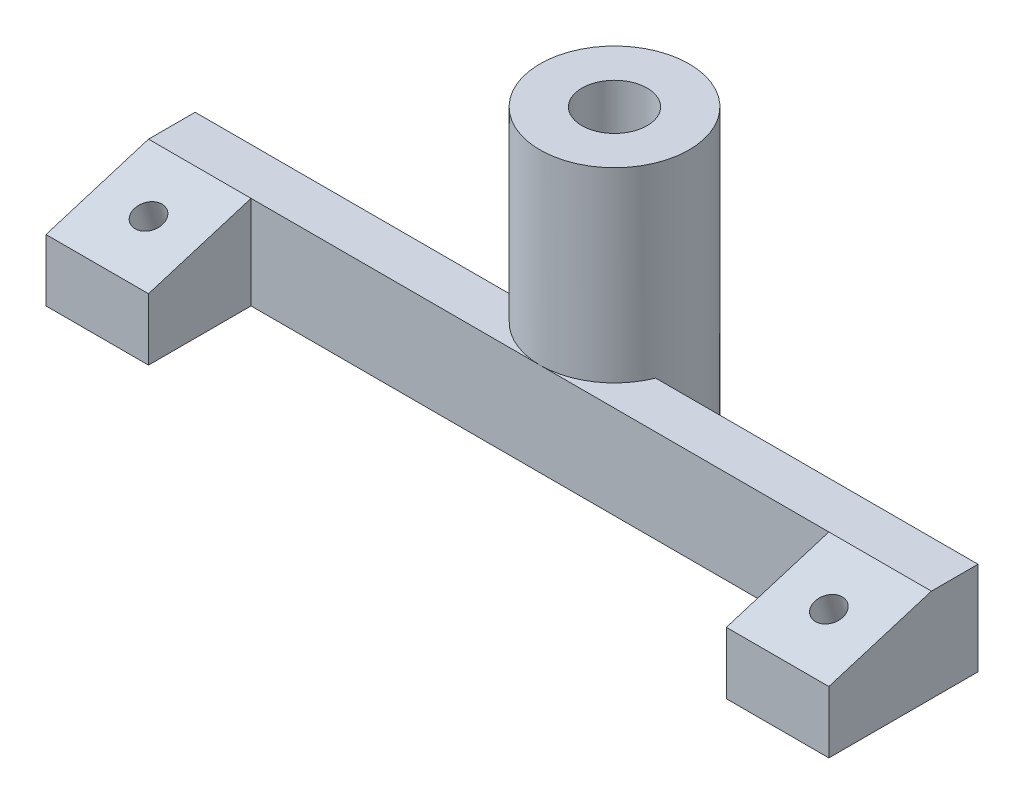
ISO-10303-21;
HEADER;
FILE_DESCRIPTION(('STEP AP214'),'2;1');
FILE_NAME('part.step','',(''),(''),'','','');
FILE_SCHEMA(('AUTOMOTIVE_DESIGN { 1 0 10303 214 1 1 1 1 }'));
ENDSEC;
DATA;
#1=APPLICATION_CONTEXT('core data for automotive mechanical design processes');
#2=APPLICATION_PROTOCOL_DEFINITION('international standard','automotive_design',2000,#1);
#3=PRODUCT_CONTEXT('',#1,'mechanical');
#4=PRODUCT('Part','Part','',(#3));
#5=PRODUCT_RELATED_PRODUCT_CATEGORY('part','',(#4));
#6=PRODUCT_DEFINITION_FORMATION('','',#4);
#7=PRODUCT_DEFINITION_CONTEXT('part definition',#1,'design');
#8=PRODUCT_DEFINITION('design','',#6,#7);
#9=PRODUCT_DEFINITION_SHAPE('','',#8);
#10=(LENGTH_UNIT() NAMED_UNIT(*) SI_UNIT(.MILLI.,.METRE.));
#11=(NAMED_UNIT(*) PLANE_ANGLE_UNIT() SI_UNIT($,.RADIAN.));
#12=(NAMED_UNIT(*) SI_UNIT($,.STERADIAN.) SOLID_ANGLE_UNIT());
#13=UNCERTAINTY_MEASURE_WITH_UNIT(LENGTH_MEASURE(1.E-05),#10,'distance_accuracy_value','');
#14=(GEOMETRIC_REPRESENTATION_CONTEXT(3) GLOBAL_UNCERTAINTY_ASSIGNED_CONTEXT((#13)) GLOBAL_UNIT_ASSIGNED_CONTEXT((#10,
#11,#12)) REPRESENTATION_CONTEXT('',''));
#15=CARTESIAN_POINT('',(0.,0.,0.));
#16=DIRECTION('',(0.,0.,1.));
#17=DIRECTION('',(1.,0.,0.));
#18=AXIS2_PLACEMENT_3D('',#15,#16,#17);
#19=CARTESIAN_POINT('',(0.,0.,-13.5));
#20=DIRECTION('',(0.,1.,0.));
#21=DIRECTION('',(0.,0.,1.));
#22=AXIS2_PLACEMENT_3D('',#19,#20,#21);
#23=CYLINDRICAL_SURFACE('',#22,3.5);
#24=CARTESIAN_POINT('',(0.,30.,-13.5));
#25=DIRECTION('',(0.,1.,0.));
#26=DIRECTION('',(0.,0.,1.));
#27=AXIS2_PLACEMENT_3D('',#24,#25,#26);
#28=CIRCLE('',#27,3.5);
#29=CARTESIAN_POINT('',(0.,30.,-10.));
#30=VERTEX_POINT('',#29);
#31=EDGE_CURVE('E143',#30,#30,#28,.T.);
#32=ORIENTED_EDGE('',*,*,#31,.T.);
#33=EDGE_LOOP('',(#32));
#34=FACE_BOUND('',#33,.T.);
#35=CARTESIAN_POINT('',(0.,24.,-13.5));
#36=DIRECTION('',(0.,-1.,0.));
#37=DIRECTION('',(0.,0.,-1.));
#38=AXIS2_PLACEMENT_3D('',#35,#36,#37);
#39=CIRCLE('',#38,3.5);
#40=CARTESIAN_POINT('',(0.,24.,-17.));
#41=VERTEX_POINT('',#40);
#42=EDGE_CURVE('E39',#41,#41,#39,.F.);
#43=ORIENTED_EDGE('',*,*,#42,.F.);
#44=EDGE_LOOP('',(#43));
#45=FACE_BOUND('',#44,.T.);
#46=ADVANCED_FACE('F35',(#34,#45),#23,.F.);
#47=CARTESIAN_POINT('',(-42.,10.,-10.5));
#48=DIRECTION('',(0.,0.,1.));
#49=DIRECTION('',(1.,0.,0.));
#50=AXIS2_PLACEMENT_3D('',#47,#48,#49);
#51=PLANE('',#50);
#52=DIRECTION('',(-1.,0.,0.));
#53=VECTOR('',#52,1.);
#54=CARTESIAN_POINT('',(-42.,10.,-10.5));
#55=LINE('',#54,#53);
#56=CARTESIAN_POINT('',(-7.41619848709566,10.,-10.5));
#57=VERTEX_POINT('',#56);
#58=CARTESIAN_POINT('',(-42.,10.,-10.5));
#59=VERTEX_POINT('',#58);
#60=EDGE_CURVE('E226',#57,#59,#55,.T.);
#61=ORIENTED_EDGE('',*,*,#60,.F.);
#62=DIRECTION('',(0.,-1.,0.));
#63=VECTOR('',#62,1.);
#64=CARTESIAN_POINT('',(-7.41619848709566,30.,-10.5));
#65=LINE('',#64,#63);
#66=CARTESIAN_POINT('',(-7.41619848709566,0.,-10.5));
#67=VERTEX_POINT('',#66);
#68=EDGE_CURVE('E52',#57,#67,#65,.T.);
#69=ORIENTED_EDGE('',*,*,#68,.T.);
#70=DIRECTION('',(-1.,0.,0.));
#71=VECTOR('',#70,1.);
#72=CARTESIAN_POINT('',(-42.,0.,-10.5));
#73=LINE('',#72,#71);
#74=CARTESIAN_POINT('',(-42.,0.,-10.5));
#75=VERTEX_POINT('',#74);
#76=EDGE_CURVE('E141',#67,#75,#73,.T.);
#77=ORIENTED_EDGE('',*,*,#76,.T.);
#78=DIRECTION('',(0.,-1.,0.));
#79=VECTOR('',#78,1.);
#80=CARTESIAN_POINT('',(-42.,10.,-10.5));
#81=LINE('',#80,#79);
#82=EDGE_CURVE('E181',#59,#75,#81,.T.);
#83=ORIENTED_EDGE('',*,*,#82,.F.);
#84=EDGE_LOOP('',(#61,#69,#77,#83));
#85=FACE_BOUND('',#84,.T.);
#86=ADVANCED_FACE('F268',(#85),#51,.F.);
#87=CARTESIAN_POINT('',(0.,10.,0.));
#88=DIRECTION('',(0.,-1.,0.));
#89=DIRECTION('',(0.,0.,-1.));
#90=AXIS2_PLACEMENT_3D('',#87,#88,#89);
#91=PLANE('',#90);
#92=CARTESIAN_POINT('',(42.,10.,-10.5));
#93=VERTEX_POINT('',#92);
#94=CARTESIAN_POINT('',(7.41619848709566,10.,-10.5));
#95=VERTEX_POINT('',#94);
#96=EDGE_CURVE('E227',#93,#95,#55,.T.);
#97=ORIENTED_EDGE('',*,*,#96,.T.);
#98=CARTESIAN_POINT('',(0.,10.,-13.5));
#99=DIRECTION('',(0.,-1.,0.));
#100=DIRECTION('',(0.,0.,-1.));
#101=AXIS2_PLACEMENT_3D('',#98,#99,#100);
#102=CIRCLE('',#101,8.);
#103=CARTESIAN_POINT('',(0.,10.,-5.5));
#104=VERTEX_POINT('',#103);
#105=EDGE_CURVE('E127',#95,#104,#102,.T.);
#106=ORIENTED_EDGE('',*,*,#105,.T.);
#107=DIRECTION('',(1.,0.,0.));
#108=VECTOR('',#107,1.);
#109=CARTESIAN_POINT('',(-31.,10.,-5.5));
#110=LINE('',#109,#108);
#111=CARTESIAN_POINT('',(31.,10.,-5.5));
#112=VERTEX_POINT('',#111);
#113=EDGE_CURVE('E232',#104,#112,#110,.T.);
#114=ORIENTED_EDGE('',*,*,#113,.T.);
#115=DIRECTION('',(-1.,0.,0.));
#116=VECTOR('',#115,1.);
#117=CARTESIAN_POINT('',(42.,10.,-5.5));
#118=LINE('',#117,#116);
#119=CARTESIAN_POINT('',(42.,10.,-5.5));
#120=VERTEX_POINT('',#119);
#121=EDGE_CURVE('E211',#120,#112,#118,.T.);
#122=ORIENTED_EDGE('',*,*,#121,.F.);
#123=DIRECTION('',(0.,0.,-1.));
#124=VECTOR('',#123,1.);
#125=CARTESIAN_POINT('',(42.,10.,-5.5));
#126=LINE('',#125,#124);
#127=EDGE_CURVE('E167',#120,#93,#126,.T.);
#128=ORIENTED_EDGE('',*,*,#127,.T.);
#129=EDGE_LOOP('',(#97,#106,#114,#122,#128));
#130=FACE_BOUND('',#129,.T.);
#131=ADVANCED_FACE('F298',(#130),#91,.F.);
#132=CARTESIAN_POINT('',(31.,10.,5.5));
#133=DIRECTION('',(0.,0.,-1.));
#134=DIRECTION('',(-1.,0.,0.));
#135=AXIS2_PLACEMENT_3D('',#132,#133,#134);
#136=PLANE('',#135);
#137=DIRECTION('',(0.,-1.,0.));
#138=VECTOR('',#137,1.);
#139=CARTESIAN_POINT('',(42.,10.,5.5));
#140=LINE('',#139,#138);
#141=CARTESIAN_POINT('',(42.,6.63696250395473,5.5));
#142=VERTEX_POINT('',#141);
#143=CARTESIAN_POINT('',(42.,0.,5.5));
#144=VERTEX_POINT('',#143);
#145=EDGE_CURVE('E44',#142,#144,#140,.T.);
#146=ORIENTED_EDGE('',*,*,#145,.F.);
#147=DIRECTION('',(-1.,0.,0.));
#148=VECTOR('',#147,1.);
#149=CARTESIAN_POINT('',(42.,6.63696250395473,5.5));
#150=LINE('',#149,#148);
#151=CARTESIAN_POINT('',(31.,6.63696250395473,5.5));
#152=VERTEX_POINT('',#151);
#153=EDGE_CURVE('E213',#142,#152,#150,.T.);
#154=ORIENTED_EDGE('',*,*,#153,.T.);
#155=DIRECTION('',(0.,-1.,0.));
#156=VECTOR('',#155,1.);
#157=CARTESIAN_POINT('',(31.,10.,5.5));
#158=LINE('',#157,#156);
#159=CARTESIAN_POINT('',(31.,0.,5.5));
#160=VERTEX_POINT('',#159);
#161=EDGE_CURVE('E168',#152,#160,#158,.T.);
#162=ORIENTED_EDGE('',*,*,#161,.T.);
#163=DIRECTION('',(1.,0.,0.));
#164=VECTOR('',#163,1.);
#165=CARTESIAN_POINT('',(31.,0.,5.5));
#166=LINE('',#165,#164);
#167=EDGE_CURVE('E224',#160,#144,#166,.T.);
#168=ORIENTED_EDGE('',*,*,#167,.T.);
#169=EDGE_LOOP('',(#146,#154,#162,#168));
#170=FACE_BOUND('',#169,.T.);
#171=ADVANCED_FACE('F37',(#170),#136,.F.);
#172=CARTESIAN_POINT('',(42.,10.,-10.5));
#173=DIRECTION('',(-1.,0.,0.));
#174=DIRECTION('',(0.,0.,1.));
#175=AXIS2_PLACEMENT_3D('',#172,#173,#174);
#176=PLANE('',#175);
#177=ORIENTED_EDGE('',*,*,#127,.F.);
#178=DIRECTION('',(0.,-0.292371704722737,0.956304755963035));
#179=VECTOR('',#178,1.);
#180=CARTESIAN_POINT('',(42.,10.,-5.5));
#181=LINE('',#180,#179);
#182=EDGE_CURVE('E60',#120,#142,#181,.T.);
#183=ORIENTED_EDGE('',*,*,#182,.T.);
#184=ORIENTED_EDGE('',*,*,#145,.T.);
#185=DIRECTION('',(0.,0.,-1.));
#186=VECTOR('',#185,1.);
#187=CARTESIAN_POINT('',(42.,0.,-10.5));
#188=LINE('',#187,#186);
#189=CARTESIAN_POINT('',(42.,0.,-10.5));
#190=VERTEX_POINT('',#189);
#191=EDGE_CURVE('E154',#144,#190,#188,.T.);
#192=ORIENTED_EDGE('',*,*,#191,.T.);
#193=DIRECTION('',(0.,-1.,0.));
#194=VECTOR('',#193,1.);
#195=CARTESIAN_POINT('',(42.,10.,-10.5));
#196=LINE('',#195,#194);
#197=EDGE_CURVE('E148',#93,#190,#196,.T.);
#198=ORIENTED_EDGE('',*,*,#197,.F.);
#199=EDGE_LOOP('',(#177,#183,#184,#192,#198));
#200=FACE_BOUND('',#199,.T.);
#201=ADVANCED_FACE('F240',(#200),#176,.F.);
#202=CARTESIAN_POINT('',(7.41619848709566,0.,-10.5));
#203=VERTEX_POINT('',#202);
#204=EDGE_CURVE('E139',#190,#203,#73,.T.);
#205=ORIENTED_EDGE('',*,*,#204,.T.);
#206=DIRECTION('',(0.,-1.,0.));
#207=VECTOR('',#206,1.);
#208=CARTESIAN_POINT('',(7.41619848709566,30.,-10.5));
#209=LINE('',#208,#207);
#210=EDGE_CURVE('E122',#203,#95,#209,.F.);
#211=ORIENTED_EDGE('',*,*,#210,.T.);
#212=ORIENTED_EDGE('',*,*,#96,.F.);
#213=ORIENTED_EDGE('',*,*,#197,.T.);
#214=EDGE_LOOP('',(#205,#211,#212,#213));
#215=FACE_BOUND('',#214,.T.);
#216=ADVANCED_FACE('F146',(#215),#51,.F.);
#217=CARTESIAN_POINT('',(-42.,10.,-5.5));
#218=DIRECTION('',(1.,0.,0.));
#219=DIRECTION('',(0.,0.,-1.));
#220=AXIS2_PLACEMENT_3D('',#217,#218,#219);
#221=PLANE('',#220);
#222=DIRECTION('',(0.,-1.,0.));
#223=VECTOR('',#222,1.);
#224=CARTESIAN_POINT('',(-42.,10.,5.5));
#225=LINE('',#224,#223);
#226=CARTESIAN_POINT('',(-42.,6.63696250395473,5.5));
#227=VERTEX_POINT('',#226);
#228=CARTESIAN_POINT('',(-42.,0.,5.5));
#229=VERTEX_POINT('',#228);
#230=EDGE_CURVE('E179',#227,#229,#225,.T.);
#231=ORIENTED_EDGE('',*,*,#230,.F.);
#232=DIRECTION('',(0.,-0.292371704722737,0.956304755963035));
#233=VECTOR('',#232,1.);
#234=CARTESIAN_POINT('',(-42.,10.,-5.5));
#235=LINE('',#234,#233);
#236=CARTESIAN_POINT('',(-42.,10.,-5.5));
#237=VERTEX_POINT('',#236);
#238=EDGE_CURVE('E206',#237,#227,#235,.T.);
#239=ORIENTED_EDGE('',*,*,#238,.F.);
#240=DIRECTION('',(0.,0.,1.));
#241=VECTOR('',#240,1.);
#242=CARTESIAN_POINT('',(-42.,10.,-5.5));
#243=LINE('',#242,#241);
#244=EDGE_CURVE('E229',#59,#237,#243,.T.);
#245=ORIENTED_EDGE('',*,*,#244,.F.);
#246=ORIENTED_EDGE('',*,*,#82,.T.);
#247=DIRECTION('',(0.,0.,1.));
#248=VECTOR('',#247,1.);
#249=CARTESIAN_POINT('',(-42.,0.,-5.5));
#250=LINE('',#249,#248);
#251=EDGE_CURVE('E149',#75,#229,#250,.T.);
#252=ORIENTED_EDGE('',*,*,#251,.T.);
#253=EDGE_LOOP('',(#231,#239,#245,#246,#252));
#254=FACE_BOUND('',#253,.T.);
#255=ADVANCED_FACE('F263',(#254),#221,.F.);
#256=CARTESIAN_POINT('',(-42.,10.,5.5));
#257=DIRECTION('',(0.,0.,-1.));
#258=DIRECTION('',(-1.,0.,0.));
#259=AXIS2_PLACEMENT_3D('',#256,#257,#258);
#260=PLANE('',#259);
#261=DIRECTION('',(0.,-1.,0.));
#262=VECTOR('',#261,1.);
#263=CARTESIAN_POINT('',(-31.,10.,5.5));
#264=LINE('',#263,#262);
#265=CARTESIAN_POINT('',(-31.,6.63696250395473,5.5));
#266=VERTEX_POINT('',#265);
#267=CARTESIAN_POINT('',(-31.,0.,5.5));
#268=VERTEX_POINT('',#267);
#269=EDGE_CURVE('E177',#266,#268,#264,.T.);
#270=ORIENTED_EDGE('',*,*,#269,.F.);
#271=EDGE_CURVE('E217',#266,#227,#150,.T.);
#272=ORIENTED_EDGE('',*,*,#271,.T.);
#273=ORIENTED_EDGE('',*,*,#230,.T.);
#274=DIRECTION('',(1.,0.,0.));
#275=VECTOR('',#274,1.);
#276=CARTESIAN_POINT('',(-42.,0.,5.5));
#277=LINE('',#276,#275);
#278=EDGE_CURVE('E152',#229,#268,#277,.T.);
#279=ORIENTED_EDGE('',*,*,#278,.T.);
#280=EDGE_LOOP('',(#270,#272,#273,#279));
#281=FACE_BOUND('',#280,.T.);
#282=ADVANCED_FACE('F258',(#281),#260,.F.);
#283=CARTESIAN_POINT('',(-31.,10.,-5.5));
#284=DIRECTION('',(-1.,0.,0.));
#285=DIRECTION('',(0.,0.,1.));
#286=AXIS2_PLACEMENT_3D('',#283,#284,#285);
#287=PLANE('',#286);
#288=DIRECTION('',(0.,-1.,0.));
#289=VECTOR('',#288,1.);
#290=CARTESIAN_POINT('',(-31.,10.,-5.5));
#291=LINE('',#290,#289);
#292=CARTESIAN_POINT('',(-31.,10.,-5.5));
#293=VERTEX_POINT('',#292);
#294=CARTESIAN_POINT('',(-31.,0.,-5.5));
#295=VERTEX_POINT('',#294);
#296=EDGE_CURVE('E174',#293,#295,#291,.T.);
#297=ORIENTED_EDGE('',*,*,#296,.F.);
#298=DIRECTION('',(0.,-0.292371704722737,0.956304755963035));
#299=VECTOR('',#298,1.);
#300=CARTESIAN_POINT('',(-31.,10.,-5.5));
#301=LINE('',#300,#299);
#302=EDGE_CURVE('E221',#293,#266,#301,.T.);
#303=ORIENTED_EDGE('',*,*,#302,.T.);
#304=ORIENTED_EDGE('',*,*,#269,.T.);
#305=DIRECTION('',(0.,0.,-1.));
#306=VECTOR('',#305,1.);
#307=CARTESIAN_POINT('',(-31.,0.,-5.5));
#308=LINE('',#307,#306);
#309=EDGE_CURVE('E160',#268,#295,#308,.T.);
#310=ORIENTED_EDGE('',*,*,#309,.T.);
#311=EDGE_LOOP('',(#297,#303,#304,#310));
#312=FACE_BOUND('',#311,.T.);
#313=ADVANCED_FACE('F254',(#312),#287,.F.);
#314=CARTESIAN_POINT('',(-31.,10.,-5.5));
#315=DIRECTION('',(0.,0.,-1.));
#316=DIRECTION('',(-1.,0.,0.));
#317=AXIS2_PLACEMENT_3D('',#314,#315,#316);
#318=PLANE('',#317);
#319=ORIENTED_EDGE('',*,*,#113,.F.);
#320=EDGE_CURVE('E171',#293,#104,#110,.T.);
#321=ORIENTED_EDGE('',*,*,#320,.F.);
#322=ORIENTED_EDGE('',*,*,#296,.T.);
#323=DIRECTION('',(1.,0.,0.));
#324=VECTOR('',#323,1.);
#325=CARTESIAN_POINT('',(-31.,0.,-5.5));
#326=LINE('',#325,#324);
#327=CARTESIAN_POINT('',(31.,0.,-5.5));
#328=VERTEX_POINT('',#327);
#329=EDGE_CURVE('E162',#295,#328,#326,.T.);
#330=ORIENTED_EDGE('',*,*,#329,.T.);
#331=DIRECTION('',(0.,-1.,0.));
#332=VECTOR('',#331,1.);
#333=CARTESIAN_POINT('',(31.,10.,-5.5));
#334=LINE('',#333,#332);
#335=EDGE_CURVE('E170',#112,#328,#334,.T.);
#336=ORIENTED_EDGE('',*,*,#335,.F.);
#337=EDGE_LOOP('',(#319,#321,#322,#330,#336));
#338=FACE_BOUND('',#337,.T.);
#339=ADVANCED_FACE('F250',(#338),#318,.F.);
#340=CARTESIAN_POINT('',(31.,10.,-5.5));
#341=DIRECTION('',(1.,0.,0.));
#342=DIRECTION('',(0.,0.,-1.));
#343=AXIS2_PLACEMENT_3D('',#340,#341,#342);
#344=PLANE('',#343);
#345=ORIENTED_EDGE('',*,*,#161,.F.);
#346=DIRECTION('',(0.,0.292371704722737,-0.956304755963035));
#347=VECTOR('',#346,1.);
#348=CARTESIAN_POINT('',(31.,10.,-5.5));
#349=LINE('',#348,#347);
#350=EDGE_CURVE('E216',#152,#112,#349,.T.);
#351=ORIENTED_EDGE('',*,*,#350,.T.);
#352=ORIENTED_EDGE('',*,*,#335,.T.);
#353=DIRECTION('',(0.,0.,1.));
#354=VECTOR('',#353,1.);
#355=CARTESIAN_POINT('',(31.,0.,-5.5));
#356=LINE('',#355,#354);
#357=EDGE_CURVE('E164',#328,#160,#356,.T.);
#358=ORIENTED_EDGE('',*,*,#357,.T.);
#359=EDGE_LOOP('',(#345,#351,#352,#358));
#360=FACE_BOUND('',#359,.T.);
#361=ADVANCED_FACE('F246',(#360),#344,.F.);
#362=ORIENTED_EDGE('',*,*,#320,.T.);
#363=EDGE_CURVE('E317',#104,#57,#102,.T.);
#364=ORIENTED_EDGE('',*,*,#363,.T.);
#365=ORIENTED_EDGE('',*,*,#60,.T.);
#366=ORIENTED_EDGE('',*,*,#244,.T.);
#367=DIRECTION('',(1.,0.,0.));
#368=VECTOR('',#367,1.);
#369=CARTESIAN_POINT('',(0.,10.,-5.5));
#370=LINE('',#369,#368);
#371=EDGE_CURVE('E11',#237,#293,#370,.T.);
#372=ORIENTED_EDGE('',*,*,#371,.T.);
#373=EDGE_LOOP('',(#362,#364,#365,#366,#372));
#374=FACE_BOUND('',#373,.T.);
#375=ADVANCED_FACE('F337',(#374),#91,.F.);
#376=CARTESIAN_POINT('',(0.,0.,0.));
#377=DIRECTION('',(0.,-1.,0.));
#378=DIRECTION('',(0.,0.,-1.));
#379=AXIS2_PLACEMENT_3D('',#376,#377,#378);
#380=PLANE('',#379);
#381=CARTESIAN_POINT('',(0.,0.,-13.5));
#382=DIRECTION('',(0.,-1.,0.));
#383=DIRECTION('',(0.,0.,-1.));
#384=AXIS2_PLACEMENT_3D('',#381,#382,#383);
#385=CIRCLE('',#384,5.25);
#386=CARTESIAN_POINT('',(0.,0.,-18.75));
#387=VERTEX_POINT('',#386);
#388=EDGE_CURVE('E321',#387,#387,#385,.T.);
#389=ORIENTED_EDGE('',*,*,#388,.F.);
#390=EDGE_LOOP('',(#389));
#391=FACE_BOUND('',#390,.T.);
#392=ORIENTED_EDGE('',*,*,#76,.F.);
#393=CARTESIAN_POINT('',(0.,0.,-13.5));
#394=DIRECTION('',(0.,-1.,0.));
#395=DIRECTION('',(0.,0.,-1.));
#396=AXIS2_PLACEMENT_3D('',#393,#394,#395);
#397=CIRCLE('',#396,8.);
#398=EDGE_CURVE('E125',#67,#203,#397,.T.);
#399=ORIENTED_EDGE('',*,*,#398,.T.);
#400=ORIENTED_EDGE('',*,*,#204,.F.);
#401=ORIENTED_EDGE('',*,*,#191,.F.);
#402=ORIENTED_EDGE('',*,*,#167,.F.);
#403=ORIENTED_EDGE('',*,*,#357,.F.);
#404=ORIENTED_EDGE('',*,*,#329,.F.);
#405=ORIENTED_EDGE('',*,*,#309,.F.);
#406=ORIENTED_EDGE('',*,*,#278,.F.);
#407=ORIENTED_EDGE('',*,*,#251,.F.);
#408=EDGE_LOOP('',(#392,#399,#400,#401,#402,#403,#404,#405,#406,#407));
#409=FACE_BOUND('',#408,.T.);
#410=CARTESIAN_POINT('',(-36.5,0.,-2.54321494186814));
#411=DIRECTION('',(0.,-1.,0.));
#412=DIRECTION('',(0.,0.,1.));
#413=AXIS2_PLACEMENT_3D('',#410,#411,#412);
#414=ELLIPSE('',#413,3.39849820858323,3.25);
#415=CARTESIAN_POINT('',(-36.5,0.,0.855283266715096));
#416=VERTEX_POINT('',#415);
#417=EDGE_CURVE('E195',#416,#416,#414,.T.);
#418=ORIENTED_EDGE('',*,*,#417,.F.);
#419=EDGE_LOOP('',(#418));
#420=FACE_BOUND('',#419,.T.);
#421=CARTESIAN_POINT('',(36.5,0.,-2.54321494186814));
#422=DIRECTION('',(0.,-1.,0.));
#423=DIRECTION('',(0.,0.,1.));
#424=AXIS2_PLACEMENT_3D('',#421,#422,#423);
#425=ELLIPSE('',#424,3.39849820858323,3.25);
#426=CARTESIAN_POINT('',(36.5,0.,0.855283266715096));
#427=VERTEX_POINT('',#426);
#428=EDGE_CURVE('E193',#427,#427,#425,.T.);
#429=ORIENTED_EDGE('',*,*,#428,.F.);
#430=EDGE_LOOP('',(#429));
#431=FACE_BOUND('',#430,.T.);
#432=ADVANCED_FACE('F136',(#391,#409,#420,#431),#380,.T.);
#433=CARTESIAN_POINT('',(42.,10.,-5.5));
#434=DIRECTION('',(0.,-0.956304755963035,-0.292371704722737));
#435=DIRECTION('',(0.,0.292371704722737,-0.956304755963035));
#436=AXIS2_PLACEMENT_3D('',#433,#434,#435);
#437=PLANE('',#436);
#438=CARTESIAN_POINT('',(36.5,8.31848125197737,0.));
#439=DIRECTION('',(0.,-0.956304755963035,-0.292371704722737));
#440=DIRECTION('',(0.,0.292371704722737,-0.956304755963035));
#441=AXIS2_PLACEMENT_3D('',#438,#439,#440);
#442=CIRCLE('',#441,1.5);
#443=CARTESIAN_POINT('',(36.5,8.75703880906148,-1.43445713394456));
#444=VERTEX_POINT('',#443);
#445=EDGE_CURVE('E197',#444,#444,#442,.T.);
#446=ORIENTED_EDGE('',*,*,#445,.T.);
#447=EDGE_LOOP('',(#446));
#448=FACE_BOUND('',#447,.T.);
#449=ORIENTED_EDGE('',*,*,#153,.F.);
#450=ORIENTED_EDGE('',*,*,#182,.F.);
#451=ORIENTED_EDGE('',*,*,#121,.T.);
#452=ORIENTED_EDGE('',*,*,#350,.F.);
#453=EDGE_LOOP('',(#449,#450,#451,#452));
#454=FACE_BOUND('',#453,.T.);
#455=ADVANCED_FACE('F336',(#448,#454),#437,.F.);
#456=CARTESIAN_POINT('',(-36.5,8.31848125197737,0.));
#457=DIRECTION('',(0.,-0.956304755963035,-0.292371704722737));
#458=DIRECTION('',(0.,0.292371704722737,-0.956304755963035));
#459=AXIS2_PLACEMENT_3D('',#456,#457,#458);
#460=CIRCLE('',#459,1.5);
#461=CARTESIAN_POINT('',(-36.5,8.75703880906148,-1.43445713394456));
#462=VERTEX_POINT('',#461);
#463=EDGE_CURVE('E201',#462,#462,#460,.T.);
#464=ORIENTED_EDGE('',*,*,#463,.T.);
#465=EDGE_LOOP('',(#464));
#466=FACE_BOUND('',#465,.T.);
#467=ORIENTED_EDGE('',*,*,#371,.F.);
#468=ORIENTED_EDGE('',*,*,#238,.T.);
#469=ORIENTED_EDGE('',*,*,#271,.F.);
#470=ORIENTED_EDGE('',*,*,#302,.F.);
#471=EDGE_LOOP('',(#467,#468,#469,#470));
#472=FACE_BOUND('',#471,.T.);
#473=ADVANCED_FACE('F343',(#466,#472),#437,.F.);
#474=CARTESIAN_POINT('',(-36.5,-2.22468886947471,-3.22337058596614));
#475=DIRECTION('',(0.,0.956304755963035,0.292371704722737));
#476=DIRECTION('',(0.,-0.292371704722737,0.956304755963035));
#477=AXIS2_PLACEMENT_3D('',#474,#475,#476);
#478=CYLINDRICAL_SURFACE('',#477,1.5);
#479=CARTESIAN_POINT('',(-36.5,4.49326222812523,-1.16948681889095));
#480=DIRECTION('',(0.,0.956304755963035,0.292371704722737));
#481=DIRECTION('',(0.,-0.292371704722737,0.956304755963035));
#482=AXIS2_PLACEMENT_3D('',#479,#480,#481);
#483=CIRCLE('',#482,1.5);
#484=CARTESIAN_POINT('',(-36.5,4.05470467104112,0.264970315053607));
#485=VERTEX_POINT('',#484);
#486=EDGE_CURVE('E189',#485,#485,#483,.T.);
#487=ORIENTED_EDGE('',*,*,#486,.F.);
#488=EDGE_LOOP('',(#487));
#489=FACE_BOUND('',#488,.T.);
#490=ORIENTED_EDGE('',*,*,#463,.F.);
#491=EDGE_LOOP('',(#490));
#492=FACE_BOUND('',#491,.T.);
#493=ADVANCED_FACE('F413',(#489,#492),#478,.F.);
#494=CARTESIAN_POINT('',(36.5,-2.22468886947471,-3.22337058596614));
#495=DIRECTION('',(0.,0.956304755963035,0.292371704722737));
#496=DIRECTION('',(0.,-0.292371704722737,0.956304755963035));
#497=AXIS2_PLACEMENT_3D('',#494,#495,#496);
#498=CYLINDRICAL_SURFACE('',#497,1.5);
#499=CARTESIAN_POINT('',(36.5,4.49326222812523,-1.16948681889095));
#500=DIRECTION('',(0.,0.956304755963035,0.292371704722737));
#501=DIRECTION('',(0.,-0.292371704722737,0.956304755963035));
#502=AXIS2_PLACEMENT_3D('',#499,#500,#501);
#503=CIRCLE('',#502,1.5);
#504=CARTESIAN_POINT('',(36.5,4.05470467104112,0.264970315053607));
#505=VERTEX_POINT('',#504);
#506=EDGE_CURVE('E186',#505,#505,#503,.T.);
#507=ORIENTED_EDGE('',*,*,#506,.F.);
#508=EDGE_LOOP('',(#507));
#509=FACE_BOUND('',#508,.T.);
#510=ORIENTED_EDGE('',*,*,#445,.F.);
#511=EDGE_LOOP('',(#510));
#512=FACE_BOUND('',#511,.T.);
#513=ADVANCED_FACE('F403',(#509,#512),#498,.F.);
#514=CARTESIAN_POINT('',(36.5,-2.22468886947471,-3.22337058596614));
#515=DIRECTION('',(0.,0.956304755963035,0.292371704722737));
#516=DIRECTION('',(0.,-0.292371704722737,0.956304755963035));
#517=AXIS2_PLACEMENT_3D('',#514,#515,#516);
#518=CYLINDRICAL_SURFACE('',#517,3.25);
#519=ORIENTED_EDGE('',*,*,#428,.T.);
#520=EDGE_LOOP('',(#519));
#521=FACE_BOUND('',#520,.T.);
#522=CARTESIAN_POINT('',(36.5,4.49326222812523,-1.16948681889095));
#523=DIRECTION('',(0.,0.956304755963035,0.292371704722737));
#524=DIRECTION('',(0.,-0.292371704722737,0.956304755963035));
#525=AXIS2_PLACEMENT_3D('',#522,#523,#524);
#526=CIRCLE('',#525,3.25);
#527=CARTESIAN_POINT('',(36.5,3.54305418777633,1.93850363798892));
#528=VERTEX_POINT('',#527);
#529=EDGE_CURVE('E269',#528,#528,#526,.T.);
#530=ORIENTED_EDGE('',*,*,#529,.T.);
#531=EDGE_LOOP('',(#530));
#532=FACE_BOUND('',#531,.T.);
#533=ADVANCED_FACE('F393',(#521,#532),#518,.F.);
#534=CARTESIAN_POINT('',(36.5,4.49326222812523,-1.16948681889095));
#535=DIRECTION('',(0.,0.956304755963035,0.292371704722737));
#536=DIRECTION('',(0.,-0.292371704722737,0.956304755963035));
#537=AXIS2_PLACEMENT_3D('',#534,#535,#536);
#538=PLANE('',#537);
#539=ORIENTED_EDGE('',*,*,#506,.T.);
#540=EDGE_LOOP('',(#539));
#541=FACE_BOUND('',#540,.T.);
#542=ORIENTED_EDGE('',*,*,#529,.F.);
#543=EDGE_LOOP('',(#542));
#544=FACE_BOUND('',#543,.T.);
#545=ADVANCED_FACE('F290',(#541,#544),#538,.F.);
#546=CARTESIAN_POINT('',(-36.5,-2.22468886947471,-3.22337058596614));
#547=DIRECTION('',(0.,0.956304755963035,0.292371704722737));
#548=DIRECTION('',(0.,-0.292371704722737,0.956304755963035));
#549=AXIS2_PLACEMENT_3D('',#546,#547,#548);
#550=CYLINDRICAL_SURFACE('',#549,3.25);
#551=ORIENTED_EDGE('',*,*,#417,.T.);
#552=EDGE_LOOP('',(#551));
#553=FACE_BOUND('',#552,.T.);
#554=CARTESIAN_POINT('',(-36.5,4.49326222812523,-1.16948681889095));
#555=DIRECTION('',(0.,0.956304755963035,0.292371704722737));
#556=DIRECTION('',(0.,-0.292371704722737,0.956304755963035));
#557=AXIS2_PLACEMENT_3D('',#554,#555,#556);
#558=CIRCLE('',#557,3.25);
#559=CARTESIAN_POINT('',(-36.5,3.54305418777633,1.93850363798892));
#560=VERTEX_POINT('',#559);
#561=EDGE_CURVE('E190',#560,#560,#558,.T.);
#562=ORIENTED_EDGE('',*,*,#561,.T.);
#563=EDGE_LOOP('',(#562));
#564=FACE_BOUND('',#563,.T.);
#565=ADVANCED_FACE('F277',(#553,#564),#550,.F.);
#566=CARTESIAN_POINT('',(-36.5,4.49326222812523,-1.16948681889095));
#567=DIRECTION('',(0.,0.956304755963035,0.292371704722737));
#568=DIRECTION('',(0.,-0.292371704722737,0.956304755963035));
#569=AXIS2_PLACEMENT_3D('',#566,#567,#568);
#570=PLANE('',#569);
#571=ORIENTED_EDGE('',*,*,#486,.T.);
#572=EDGE_LOOP('',(#571));
#573=FACE_BOUND('',#572,.T.);
#574=ORIENTED_EDGE('',*,*,#561,.F.);
#575=EDGE_LOOP('',(#574));
#576=FACE_BOUND('',#575,.T.);
#577=ADVANCED_FACE('F279',(#573,#576),#570,.F.);
#578=CARTESIAN_POINT('',(0.,30.,-13.5));
#579=DIRECTION('',(0.,-1.,0.));
#580=DIRECTION('',(0.,0.,-1.));
#581=AXIS2_PLACEMENT_3D('',#578,#579,#580);
#582=CYLINDRICAL_SURFACE('',#581,8.);
#583=CARTESIAN_POINT('',(0.,30.,-13.5));
#584=DIRECTION('',(0.,-1.,0.));
#585=DIRECTION('',(0.,0.,-1.));
#586=AXIS2_PLACEMENT_3D('',#583,#584,#585);
#587=CIRCLE('',#586,8.);
#588=CARTESIAN_POINT('',(0.,30.,-21.5));
#589=VERTEX_POINT('',#588);
#590=EDGE_CURVE('E142',#589,#589,#587,.T.);
#591=ORIENTED_EDGE('',*,*,#590,.T.);
#592=EDGE_LOOP('',(#591));
#593=FACE_BOUND('',#592,.T.);
#594=ORIENTED_EDGE('',*,*,#68,.F.);
#595=ORIENTED_EDGE('',*,*,#363,.F.);
#596=ORIENTED_EDGE('',*,*,#105,.F.);
#597=ORIENTED_EDGE('',*,*,#210,.F.);
#598=ORIENTED_EDGE('',*,*,#398,.F.);
#599=EDGE_LOOP('',(#594,#595,#596,#597,#598));
#600=FACE_BOUND('',#599,.T.);
#601=ADVANCED_FACE('F124',(#593,#600),#582,.T.);
#602=CARTESIAN_POINT('',(0.,30.,-13.5));
#603=DIRECTION('',(0.,-1.,0.));
#604=DIRECTION('',(0.,0.,-1.));
#605=AXIS2_PLACEMENT_3D('',#602,#603,#604);
#606=PLANE('',#605);
#607=ORIENTED_EDGE('',*,*,#31,.F.);
#608=EDGE_LOOP('',(#607));
#609=FACE_BOUND('',#608,.T.);
#610=ORIENTED_EDGE('',*,*,#590,.F.);
#611=EDGE_LOOP('',(#610));
#612=FACE_BOUND('',#611,.T.);
#613=ADVANCED_FACE('F287',(#609,#612),#606,.F.);
#614=CARTESIAN_POINT('',(0.,24.,-13.5));
#615=DIRECTION('',(0.,-1.,0.));
#616=DIRECTION('',(0.,0.,-1.));
#617=AXIS2_PLACEMENT_3D('',#614,#615,#616);
#618=PLANE('',#617);
#619=CARTESIAN_POINT('',(0.,24.,-13.5));
#620=DIRECTION('',(0.,-1.,0.));
#621=DIRECTION('',(0.,0.,-1.));
#622=AXIS2_PLACEMENT_3D('',#619,#620,#621);
#623=CIRCLE('',#622,5.25);
#624=CARTESIAN_POINT('',(0.,24.,-18.75));
#625=VERTEX_POINT('',#624);
#626=EDGE_CURVE('E324',#625,#625,#623,.T.);
#627=ORIENTED_EDGE('',*,*,#626,.T.);
#628=EDGE_LOOP('',(#627));
#629=FACE_BOUND('',#628,.T.);
#630=ORIENTED_EDGE('',*,*,#42,.T.);
#631=EDGE_LOOP('',(#630));
#632=FACE_BOUND('',#631,.T.);
#633=ADVANCED_FACE('F307',(#629,#632),#618,.T.);
#634=CARTESIAN_POINT('',(0.,24.,-13.5));
#635=DIRECTION('',(0.,-1.,0.));
#636=DIRECTION('',(0.,0.,-1.));
#637=AXIS2_PLACEMENT_3D('',#634,#635,#636);
#638=CYLINDRICAL_SURFACE('',#637,5.25);
#639=ORIENTED_EDGE('',*,*,#626,.F.);
#640=EDGE_LOOP('',(#639));
#641=FACE_BOUND('',#640,.T.);
#642=ORIENTED_EDGE('',*,*,#388,.T.);
#643=EDGE_LOOP('',(#642));
#644=FACE_BOUND('',#643,.T.);
#645=ADVANCED_FACE('F304',(#641,#644),#638,.F.);
#646=CLOSED_SHELL('',(#46,#86,#131,#171,#201,#216,#255,#282,#313,#339,#361,#375,#432,#455,#473,
#493,#513,#533,#545,#565,#577,#601,#613,#633,#645));
#647=MANIFOLD_SOLID_BREP('B2',#646);
#648=ADVANCED_BREP_SHAPE_REPRESENTATION('',(#18,#647),#14);
#649=SHAPE_DEFINITION_REPRESENTATION(#9,#648);
ENDSEC;
END-ISO-10303-21;
